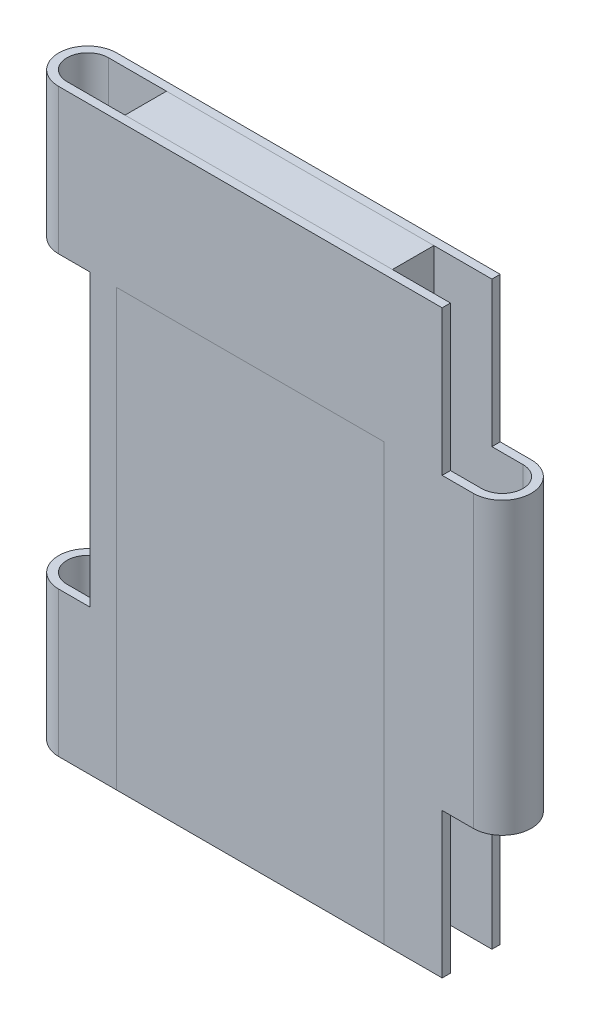
ISO-10303-21;
HEADER;
FILE_DESCRIPTION(('STEP AP214'),'2;1');
FILE_NAME('part.step','',(''),(''),'','','');
FILE_SCHEMA(('AUTOMOTIVE_DESIGN { 1 0 10303 214 1 1 1 1 }'));
ENDSEC;
DATA;
#1=APPLICATION_CONTEXT('core data for automotive mechanical design processes');
#2=APPLICATION_PROTOCOL_DEFINITION('international standard','automotive_design',2000,#1);
#3=PRODUCT_CONTEXT('',#1,'mechanical');
#4=PRODUCT('Part','Part','',(#3));
#5=PRODUCT_RELATED_PRODUCT_CATEGORY('part','',(#4));
#6=PRODUCT_DEFINITION_FORMATION('','',#4);
#7=PRODUCT_DEFINITION_CONTEXT('part definition',#1,'design');
#8=PRODUCT_DEFINITION('design','',#6,#7);
#9=PRODUCT_DEFINITION_SHAPE('','',#8);
#10=(LENGTH_UNIT() NAMED_UNIT(*) SI_UNIT(.MILLI.,.METRE.));
#11=(NAMED_UNIT(*) PLANE_ANGLE_UNIT() SI_UNIT($,.RADIAN.));
#12=(NAMED_UNIT(*) SI_UNIT($,.STERADIAN.) SOLID_ANGLE_UNIT());
#13=UNCERTAINTY_MEASURE_WITH_UNIT(LENGTH_MEASURE(1.E-05),#10,'distance_accuracy_value','');
#14=(GEOMETRIC_REPRESENTATION_CONTEXT(3) GLOBAL_UNCERTAINTY_ASSIGNED_CONTEXT((#13)) GLOBAL_UNIT_ASSIGNED_CONTEXT((#10,
#11,#12)) REPRESENTATION_CONTEXT('',''));
#15=CARTESIAN_POINT('',(0.,0.,0.));
#16=DIRECTION('',(0.,0.,1.));
#17=DIRECTION('',(1.,0.,0.));
#18=AXIS2_PLACEMENT_3D('',#15,#16,#17);
#19=CARTESIAN_POINT('',(-18.,0.,-3.50000000000002));
#20=DIRECTION('',(-1.,0.,0.));
#21=DIRECTION('',(0.,0.,1.));
#22=AXIS2_PLACEMENT_3D('',#19,#20,#21);
#23=PLANE('',#22);
#24=DIRECTION('',(0.,0.,1.));
#25=VECTOR('',#24,1.);
#26=CARTESIAN_POINT('',(-18.,70.,-3.50000000000002));
#27=LINE('',#26,#25);
#28=CARTESIAN_POINT('',(-18.,70.,-3.50000000000002));
#29=VERTEX_POINT('',#28);
#30=CARTESIAN_POINT('',(-18.,70.,3.50000000000001));
#31=VERTEX_POINT('',#30);
#32=EDGE_CURVE('E123',#29,#31,#27,.T.);
#33=ORIENTED_EDGE('',*,*,#32,.F.);
#34=DIRECTION('',(0.,1.,0.));
#35=VECTOR('',#34,1.);
#36=CARTESIAN_POINT('',(-18.,0.,-3.50000000000002));
#37=LINE('',#36,#35);
#38=CARTESIAN_POINT('',(-18.,0.,-3.50000000000002));
#39=VERTEX_POINT('',#38);
#40=EDGE_CURVE('E12',#39,#29,#37,.T.);
#41=ORIENTED_EDGE('',*,*,#40,.F.);
#42=DIRECTION('',(0.,0.,1.));
#43=VECTOR('',#42,1.);
#44=CARTESIAN_POINT('',(-18.,0.,-3.50000000000002));
#45=LINE('',#44,#43);
#46=CARTESIAN_POINT('',(-18.,0.,3.50000000000001));
#47=VERTEX_POINT('',#46);
#48=EDGE_CURVE('E115',#39,#47,#45,.T.);
#49=ORIENTED_EDGE('',*,*,#48,.T.);
#50=DIRECTION('',(0.,1.,0.));
#51=VECTOR('',#50,1.);
#52=CARTESIAN_POINT('',(-18.,0.,3.50000000000001));
#53=LINE('',#52,#51);
#54=EDGE_CURVE('E56',#47,#31,#53,.T.);
#55=ORIENTED_EDGE('',*,*,#54,.T.);
#56=EDGE_LOOP('',(#33,#41,#49,#55));
#57=FACE_BOUND('',#56,.T.);
#58=ADVANCED_FACE('F53',(#57),#23,.T.);
#59=CARTESIAN_POINT('',(-18.,0.,-3.50000000000002));
#60=DIRECTION('',(0.,0.,-1.));
#61=DIRECTION('',(-1.,0.,0.));
#62=AXIS2_PLACEMENT_3D('',#59,#60,#61);
#63=PLANE('',#62);
#64=DIRECTION('',(-1.,0.,0.));
#65=VECTOR('',#64,1.);
#66=CARTESIAN_POINT('',(-18.,70.,-3.50000000000002));
#67=LINE('',#66,#65);
#68=CARTESIAN_POINT('',(14.25,70.,-3.50000000000002));
#69=VERTEX_POINT('',#68);
#70=EDGE_CURVE('E118',#69,#29,#67,.T.);
#71=ORIENTED_EDGE('',*,*,#70,.F.);
#72=DIRECTION('',(0.,1.,0.));
#73=VECTOR('',#72,1.);
#74=CARTESIAN_POINT('',(14.25,0.,-3.50000000000002));
#75=LINE('',#74,#73);
#76=CARTESIAN_POINT('',(14.25,0.,-3.50000000000002));
#77=VERTEX_POINT('',#76);
#78=EDGE_CURVE('E63',#77,#69,#75,.T.);
#79=ORIENTED_EDGE('',*,*,#78,.F.);
#80=DIRECTION('',(-1.,0.,0.));
#81=VECTOR('',#80,1.);
#82=CARTESIAN_POINT('',(-18.,0.,-3.50000000000002));
#83=LINE('',#82,#81);
#84=EDGE_CURVE('E110',#77,#39,#83,.T.);
#85=ORIENTED_EDGE('',*,*,#84,.T.);
#86=ORIENTED_EDGE('',*,*,#40,.T.);
#87=EDGE_LOOP('',(#71,#79,#85,#86));
#88=FACE_BOUND('',#87,.T.);
#89=ADVANCED_FACE('F139',(#88),#63,.T.);
#90=CARTESIAN_POINT('',(14.25,0.,-3.50000000000002));
#91=DIRECTION('',(1.,0.,0.));
#92=DIRECTION('',(0.,0.,-1.));
#93=AXIS2_PLACEMENT_3D('',#90,#91,#92);
#94=PLANE('',#93);
#95=DIRECTION('',(0.,0.,-1.));
#96=VECTOR('',#95,1.);
#97=CARTESIAN_POINT('',(14.25,70.,-3.50000000000002));
#98=LINE('',#97,#96);
#99=CARTESIAN_POINT('',(14.25,70.,3.50000000000001));
#100=VERTEX_POINT('',#99);
#101=EDGE_CURVE('E104',#100,#69,#98,.T.);
#102=ORIENTED_EDGE('',*,*,#101,.F.);
#103=DIRECTION('',(0.,1.,0.));
#104=VECTOR('',#103,1.);
#105=CARTESIAN_POINT('',(14.25,0.,3.50000000000001));
#106=LINE('',#105,#104);
#107=CARTESIAN_POINT('',(14.25,0.,3.50000000000001));
#108=VERTEX_POINT('',#107);
#109=EDGE_CURVE('E99',#108,#100,#106,.T.);
#110=ORIENTED_EDGE('',*,*,#109,.F.);
#111=DIRECTION('',(0.,0.,-1.));
#112=VECTOR('',#111,1.);
#113=CARTESIAN_POINT('',(14.25,0.,-3.50000000000002));
#114=LINE('',#113,#112);
#115=EDGE_CURVE('E102',#108,#77,#114,.T.);
#116=ORIENTED_EDGE('',*,*,#115,.T.);
#117=ORIENTED_EDGE('',*,*,#78,.T.);
#118=EDGE_LOOP('',(#102,#110,#116,#117));
#119=FACE_BOUND('',#118,.T.);
#120=ADVANCED_FACE('F101',(#119),#94,.T.);
#121=CARTESIAN_POINT('',(-18.,0.,3.50000000000001));
#122=DIRECTION('',(0.,0.,1.));
#123=DIRECTION('',(1.,0.,0.));
#124=AXIS2_PLACEMENT_3D('',#121,#122,#123);
#125=PLANE('',#124);
#126=DIRECTION('',(1.,0.,0.));
#127=VECTOR('',#126,1.);
#128=CARTESIAN_POINT('',(-18.,70.,3.50000000000001));
#129=LINE('',#128,#127);
#130=EDGE_CURVE('E127',#31,#100,#129,.T.);
#131=ORIENTED_EDGE('',*,*,#130,.F.);
#132=ORIENTED_EDGE('',*,*,#54,.F.);
#133=DIRECTION('',(1.,0.,0.));
#134=VECTOR('',#133,1.);
#135=CARTESIAN_POINT('',(-18.,0.,3.50000000000001));
#136=LINE('',#135,#134);
#137=EDGE_CURVE('E109',#47,#108,#136,.T.);
#138=ORIENTED_EDGE('',*,*,#137,.T.);
#139=ORIENTED_EDGE('',*,*,#109,.T.);
#140=EDGE_LOOP('',(#131,#132,#138,#139));
#141=FACE_BOUND('',#140,.T.);
#142=ADVANCED_FACE('F113',(#141),#125,.T.);
#143=CARTESIAN_POINT('',(0.,0.,0.));
#144=DIRECTION('',(0.,1.,0.));
#145=DIRECTION('',(0.,0.,1.));
#146=AXIS2_PLACEMENT_3D('',#143,#144,#145);
#147=PLANE('',#146);
#148=ORIENTED_EDGE('',*,*,#48,.F.);
#149=ORIENTED_EDGE('',*,*,#84,.F.);
#150=ORIENTED_EDGE('',*,*,#115,.F.);
#151=ORIENTED_EDGE('',*,*,#137,.F.);
#152=EDGE_LOOP('',(#148,#149,#150,#151));
#153=FACE_BOUND('',#152,.T.);
#154=ADVANCED_FACE('F108',(#153),#147,.F.);
#155=CARTESIAN_POINT('',(0.,70.,0.));
#156=DIRECTION('',(0.,1.,0.));
#157=DIRECTION('',(0.,0.,1.));
#158=AXIS2_PLACEMENT_3D('',#155,#156,#157);
#159=PLANE('',#158);
#160=ORIENTED_EDGE('',*,*,#32,.T.);
#161=ORIENTED_EDGE('',*,*,#130,.T.);
#162=ORIENTED_EDGE('',*,*,#101,.T.);
#163=ORIENTED_EDGE('',*,*,#70,.T.);
#164=EDGE_LOOP('',(#160,#161,#162,#163));
#165=FACE_BOUND('',#164,.T.);
#166=ADVANCED_FACE('F138',(#165),#159,.T.);
#167=CLOSED_SHELL('',(#58,#89,#120,#142,#154,#166));
#168=MANIFOLD_SOLID_BREP('B2',#167);
#169=CARTESIAN_POINT('',(-25.,70.,0.));
#170=DIRECTION('',(0.,-1.,0.));
#171=DIRECTION('',(0.,0.,-1.));
#172=AXIS2_PLACEMENT_3D('',#169,#170,#171);
#173=CYLINDRICAL_SURFACE('',#172,3.50000000000001);
#174=DIRECTION('',(0.,-1.,0.));
#175=VECTOR('',#174,1.);
#176=CARTESIAN_POINT('',(-25.,70.,3.50000000000001));
#177=LINE('',#176,#175);
#178=CARTESIAN_POINT('',(-25.,17.5,3.5));
#179=VERTEX_POINT('',#178);
#180=CARTESIAN_POINT('',(-25.,0.,3.50000000000001));
#181=VERTEX_POINT('',#180);
#182=EDGE_CURVE('E501',#179,#181,#177,.T.);
#183=ORIENTED_EDGE('',*,*,#182,.F.);
#184=CARTESIAN_POINT('',(-25.,17.5,0.));
#185=DIRECTION('',(0.,-1.,0.));
#186=DIRECTION('',(0.,0.,-1.));
#187=AXIS2_PLACEMENT_3D('',#184,#185,#186);
#188=CIRCLE('',#187,3.50000000000001);
#189=CARTESIAN_POINT('',(-25.,17.5,-3.50000000000001));
#190=VERTEX_POINT('',#189);
#191=EDGE_CURVE('E431',#179,#190,#188,.T.);
#192=ORIENTED_EDGE('',*,*,#191,.T.);
#193=DIRECTION('',(0.,-1.,0.));
#194=VECTOR('',#193,1.);
#195=CARTESIAN_POINT('',(-25.,70.,-3.50000000000001));
#196=LINE('',#195,#194);
#197=CARTESIAN_POINT('',(-25.,0.,-3.50000000000001));
#198=VERTEX_POINT('',#197);
#199=EDGE_CURVE('E485',#190,#198,#196,.T.);
#200=ORIENTED_EDGE('',*,*,#199,.T.);
#201=CARTESIAN_POINT('',(-25.,0.,0.));
#202=DIRECTION('',(0.,1.,0.));
#203=DIRECTION('',(0.,0.,1.));
#204=AXIS2_PLACEMENT_3D('',#201,#202,#203);
#205=CIRCLE('',#204,3.50000000000001);
#206=EDGE_CURVE('E475',#198,#181,#205,.T.);
#207=ORIENTED_EDGE('',*,*,#206,.T.);
#208=EDGE_LOOP('',(#183,#192,#200,#207));
#209=FACE_BOUND('',#208,.T.);
#210=ADVANCED_FACE('F189',(#209),#173,.T.);
#211=CARTESIAN_POINT('',(-25.,70.,0.));
#212=DIRECTION('',(0.,-1.,0.));
#213=DIRECTION('',(0.,0.,-1.));
#214=AXIS2_PLACEMENT_3D('',#211,#212,#213);
#215=CYLINDRICAL_SURFACE('',#214,2.50000000000001);
#216=CARTESIAN_POINT('',(-25.,17.5,0.));
#217=DIRECTION('',(0.,-1.,0.));
#218=DIRECTION('',(0.,0.,-1.));
#219=AXIS2_PLACEMENT_3D('',#216,#217,#218);
#220=CIRCLE('',#219,2.50000000000001);
#221=CARTESIAN_POINT('',(-25.,17.5,2.50000000000001));
#222=VERTEX_POINT('',#221);
#223=CARTESIAN_POINT('',(-25.,17.5,-2.50000000000001));
#224=VERTEX_POINT('',#223);
#225=EDGE_CURVE('E427',#222,#224,#220,.T.);
#226=ORIENTED_EDGE('',*,*,#225,.F.);
#227=DIRECTION('',(0.,-1.,0.));
#228=VECTOR('',#227,1.);
#229=CARTESIAN_POINT('',(-25.,70.,2.50000000000001));
#230=LINE('',#229,#228);
#231=CARTESIAN_POINT('',(-25.,0.,2.50000000000001));
#232=VERTEX_POINT('',#231);
#233=EDGE_CURVE('E471',#222,#232,#230,.T.);
#234=ORIENTED_EDGE('',*,*,#233,.T.);
#235=CARTESIAN_POINT('',(-25.,0.,0.));
#236=DIRECTION('',(0.,1.,0.));
#237=DIRECTION('',(0.,0.,1.));
#238=AXIS2_PLACEMENT_3D('',#235,#236,#237);
#239=CIRCLE('',#238,2.50000000000001);
#240=CARTESIAN_POINT('',(-25.,0.,-2.50000000000001));
#241=VERTEX_POINT('',#240);
#242=EDGE_CURVE('E445',#241,#232,#239,.T.);
#243=ORIENTED_EDGE('',*,*,#242,.F.);
#244=DIRECTION('',(0.,-1.,0.));
#245=VECTOR('',#244,1.);
#246=CARTESIAN_POINT('',(-25.,70.,-2.50000000000001));
#247=LINE('',#246,#245);
#248=EDGE_CURVE('E454',#224,#241,#247,.T.);
#249=ORIENTED_EDGE('',*,*,#248,.F.);
#250=EDGE_LOOP('',(#226,#234,#243,#249));
#251=FACE_BOUND('',#250,.T.);
#252=ADVANCED_FACE('F534',(#251),#215,.F.);
#253=CARTESIAN_POINT('',(-25.,70.,0.));
#254=DIRECTION('',(0.,1.,0.));
#255=DIRECTION('',(0.,0.,1.));
#256=AXIS2_PLACEMENT_3D('',#253,#254,#255);
#257=PLANE('',#256);
#258=DIRECTION('',(0.,0.,1.));
#259=VECTOR('',#258,1.);
#260=CARTESIAN_POINT('',(21.25,70.,-39.2945526581909));
#261=LINE('',#260,#259);
#262=CARTESIAN_POINT('',(21.25,70.,-3.50000000000002));
#263=VERTEX_POINT('',#262);
#264=CARTESIAN_POINT('',(21.25,70.,-2.50000000000001));
#265=VERTEX_POINT('',#264);
#266=EDGE_CURVE('E413',#263,#265,#261,.T.);
#267=ORIENTED_EDGE('',*,*,#266,.F.);
#268=DIRECTION('',(-1.,0.,0.));
#269=VECTOR('',#268,1.);
#270=CARTESIAN_POINT('',(-25.,70.,-3.50000000000001));
#271=LINE('',#270,#269);
#272=CARTESIAN_POINT('',(-25.,70.,-3.50000000000001));
#273=VERTEX_POINT('',#272);
#274=EDGE_CURVE('E483',#263,#273,#271,.T.);
#275=ORIENTED_EDGE('',*,*,#274,.T.);
#276=CARTESIAN_POINT('',(-25.,70.,0.));
#277=DIRECTION('',(0.,1.,0.));
#278=DIRECTION('',(0.,0.,1.));
#279=AXIS2_PLACEMENT_3D('',#276,#277,#278);
#280=CIRCLE('',#279,3.50000000000001);
#281=CARTESIAN_POINT('',(-25.,70.,3.50000000000001));
#282=VERTEX_POINT('',#281);
#283=EDGE_CURVE('E476',#273,#282,#280,.T.);
#284=ORIENTED_EDGE('',*,*,#283,.T.);
#285=DIRECTION('',(1.,0.,0.));
#286=VECTOR('',#285,1.);
#287=CARTESIAN_POINT('',(-25.,70.,3.50000000000001));
#288=LINE('',#287,#286);
#289=CARTESIAN_POINT('',(21.25,70.,3.5));
#290=VERTEX_POINT('',#289);
#291=EDGE_CURVE('E479',#282,#290,#288,.T.);
#292=ORIENTED_EDGE('',*,*,#291,.T.);
#293=CARTESIAN_POINT('',(21.25,70.,2.5));
#294=VERTEX_POINT('',#293);
#295=EDGE_CURVE('E409',#294,#290,#261,.T.);
#296=ORIENTED_EDGE('',*,*,#295,.F.);
#297=DIRECTION('',(1.,0.,0.));
#298=VECTOR('',#297,1.);
#299=CARTESIAN_POINT('',(-25.,70.,2.50000000000001));
#300=LINE('',#299,#298);
#301=CARTESIAN_POINT('',(-25.,70.,2.50000000000001));
#302=VERTEX_POINT('',#301);
#303=EDGE_CURVE('E448',#302,#294,#300,.T.);
#304=ORIENTED_EDGE('',*,*,#303,.F.);
#305=CARTESIAN_POINT('',(-25.,70.,0.));
#306=DIRECTION('',(0.,1.,0.));
#307=DIRECTION('',(0.,0.,1.));
#308=AXIS2_PLACEMENT_3D('',#305,#306,#307);
#309=CIRCLE('',#308,2.50000000000001);
#310=CARTESIAN_POINT('',(-25.,70.,-2.50000000000001));
#311=VERTEX_POINT('',#310);
#312=EDGE_CURVE('E446',#311,#302,#309,.T.);
#313=ORIENTED_EDGE('',*,*,#312,.F.);
#314=DIRECTION('',(-1.,0.,0.));
#315=VECTOR('',#314,1.);
#316=CARTESIAN_POINT('',(-25.,70.,-2.50000000000001));
#317=LINE('',#316,#315);
#318=EDGE_CURVE('E452',#265,#311,#317,.T.);
#319=ORIENTED_EDGE('',*,*,#318,.F.);
#320=EDGE_LOOP('',(#267,#275,#284,#292,#296,#304,#313,#319));
#321=FACE_BOUND('',#320,.T.);
#322=ADVANCED_FACE('F579',(#321),#257,.T.);
#323=CARTESIAN_POINT('',(-25.,0.,0.));
#324=DIRECTION('',(0.,1.,0.));
#325=DIRECTION('',(0.,0.,1.));
#326=AXIS2_PLACEMENT_3D('',#323,#324,#325);
#327=PLANE('',#326);
#328=DIRECTION('',(-1.,0.,0.));
#329=VECTOR('',#328,1.);
#330=CARTESIAN_POINT('',(-25.,0.,-3.50000000000001));
#331=LINE('',#330,#329);
#332=CARTESIAN_POINT('',(21.25,0.,-3.50000000000002));
#333=VERTEX_POINT('',#332);
#334=EDGE_CURVE('E480',#333,#198,#331,.T.);
#335=ORIENTED_EDGE('',*,*,#334,.F.);
#336=DIRECTION('',(0.,0.,1.));
#337=VECTOR('',#336,1.);
#338=CARTESIAN_POINT('',(21.25,0.,-39.2945526581909));
#339=LINE('',#338,#337);
#340=CARTESIAN_POINT('',(21.25,0.,-2.50000000000001));
#341=VERTEX_POINT('',#340);
#342=EDGE_CURVE('E386',#333,#341,#339,.T.);
#343=ORIENTED_EDGE('',*,*,#342,.T.);
#344=DIRECTION('',(-1.,0.,0.));
#345=VECTOR('',#344,1.);
#346=CARTESIAN_POINT('',(-25.,0.,-2.50000000000001));
#347=LINE('',#346,#345);
#348=EDGE_CURVE('E449',#341,#241,#347,.T.);
#349=ORIENTED_EDGE('',*,*,#348,.T.);
#350=ORIENTED_EDGE('',*,*,#242,.T.);
#351=DIRECTION('',(1.,0.,0.));
#352=VECTOR('',#351,1.);
#353=CARTESIAN_POINT('',(-25.,0.,2.50000000000001));
#354=LINE('',#353,#352);
#355=CARTESIAN_POINT('',(21.25,0.,2.5));
#356=VERTEX_POINT('',#355);
#357=EDGE_CURVE('E457',#232,#356,#354,.T.);
#358=ORIENTED_EDGE('',*,*,#357,.T.);
#359=CARTESIAN_POINT('',(21.25,0.,3.5));
#360=VERTEX_POINT('',#359);
#361=EDGE_CURVE('E394',#356,#360,#339,.T.);
#362=ORIENTED_EDGE('',*,*,#361,.T.);
#363=DIRECTION('',(1.,0.,0.));
#364=VECTOR('',#363,1.);
#365=CARTESIAN_POINT('',(-25.,0.,3.50000000000001));
#366=LINE('',#365,#364);
#367=EDGE_CURVE('E488',#181,#360,#366,.T.);
#368=ORIENTED_EDGE('',*,*,#367,.F.);
#369=ORIENTED_EDGE('',*,*,#206,.F.);
#370=EDGE_LOOP('',(#335,#343,#349,#350,#358,#362,#368,#369));
#371=FACE_BOUND('',#370,.T.);
#372=ADVANCED_FACE('F531',(#371),#327,.F.);
#373=CARTESIAN_POINT('',(-25.,52.5,-3.50000000000001));
#374=VERTEX_POINT('',#373);
#375=EDGE_CURVE('E492',#273,#374,#196,.T.);
#376=ORIENTED_EDGE('',*,*,#375,.T.);
#377=CARTESIAN_POINT('',(-25.,52.5,0.));
#378=DIRECTION('',(0.,1.,0.));
#379=DIRECTION('',(0.,0.,1.));
#380=AXIS2_PLACEMENT_3D('',#377,#378,#379);
#381=CIRCLE('',#380,3.50000000000001);
#382=CARTESIAN_POINT('',(-25.,52.5,3.5));
#383=VERTEX_POINT('',#382);
#384=EDGE_CURVE('E204',#374,#383,#381,.T.);
#385=ORIENTED_EDGE('',*,*,#384,.T.);
#386=EDGE_CURVE('E371',#282,#383,#177,.T.);
#387=ORIENTED_EDGE('',*,*,#386,.F.);
#388=ORIENTED_EDGE('',*,*,#283,.F.);
#389=EDGE_LOOP('',(#376,#385,#387,#388));
#390=FACE_BOUND('',#389,.T.);
#391=ADVANCED_FACE('F191',(#390),#173,.T.);
#392=CARTESIAN_POINT('',(-25.,70.,3.50000000000001));
#393=DIRECTION('',(0.,0.,-1.));
#394=DIRECTION('',(-1.,0.,0.));
#395=AXIS2_PLACEMENT_3D('',#392,#393,#394);
#396=PLANE('',#395);
#397=ORIENTED_EDGE('',*,*,#367,.T.);
#398=DIRECTION('',(0.,-1.,0.));
#399=VECTOR('',#398,1.);
#400=CARTESIAN_POINT('',(21.25,17.5,3.5));
#401=LINE('',#400,#399);
#402=CARTESIAN_POINT('',(21.25,17.5,3.5));
#403=VERTEX_POINT('',#402);
#404=EDGE_CURVE('E389',#403,#360,#401,.T.);
#405=ORIENTED_EDGE('',*,*,#404,.F.);
#406=DIRECTION('',(-1.,0.,0.));
#407=VECTOR('',#406,1.);
#408=CARTESIAN_POINT('',(21.25,17.5,3.5));
#409=LINE('',#408,#407);
#410=CARTESIAN_POINT('',(25.,17.5,3.5));
#411=VERTEX_POINT('',#410);
#412=EDGE_CURVE('E387',#411,#403,#409,.T.);
#413=ORIENTED_EDGE('',*,*,#412,.F.);
#414=DIRECTION('',(0.,-1.,0.));
#415=VECTOR('',#414,1.);
#416=CARTESIAN_POINT('',(25.,70.,3.5));
#417=LINE('',#416,#415);
#418=CARTESIAN_POINT('',(25.,52.5,3.5));
#419=VERTEX_POINT('',#418);
#420=EDGE_CURVE('E498',#419,#411,#417,.T.);
#421=ORIENTED_EDGE('',*,*,#420,.F.);
#422=DIRECTION('',(1.,0.,0.));
#423=VECTOR('',#422,1.);
#424=CARTESIAN_POINT('',(21.25,52.5,3.5));
#425=LINE('',#424,#423);
#426=CARTESIAN_POINT('',(21.25,52.5,3.5));
#427=VERTEX_POINT('',#426);
#428=EDGE_CURVE('E407',#427,#419,#425,.T.);
#429=ORIENTED_EDGE('',*,*,#428,.F.);
#430=DIRECTION('',(0.,-1.,0.));
#431=VECTOR('',#430,1.);
#432=CARTESIAN_POINT('',(21.25,52.5,3.5));
#433=LINE('',#432,#431);
#434=EDGE_CURVE('E382',#290,#427,#433,.T.);
#435=ORIENTED_EDGE('',*,*,#434,.F.);
#436=ORIENTED_EDGE('',*,*,#291,.F.);
#437=ORIENTED_EDGE('',*,*,#386,.T.);
#438=DIRECTION('',(-1.,0.,0.));
#439=VECTOR('',#438,1.);
#440=CARTESIAN_POINT('',(-28.75,52.5,3.5));
#441=LINE('',#440,#439);
#442=CARTESIAN_POINT('',(-21.25,52.5,3.5));
#443=VERTEX_POINT('',#442);
#444=EDGE_CURVE('E350',#443,#383,#441,.T.);
#445=ORIENTED_EDGE('',*,*,#444,.F.);
#446=DIRECTION('',(0.,1.,0.));
#447=VECTOR('',#446,1.);
#448=CARTESIAN_POINT('',(-21.25,17.5,3.5));
#449=LINE('',#448,#447);
#450=CARTESIAN_POINT('',(-21.25,17.5,3.5));
#451=VERTEX_POINT('',#450);
#452=EDGE_CURVE('E359',#451,#443,#449,.T.);
#453=ORIENTED_EDGE('',*,*,#452,.F.);
#454=DIRECTION('',(1.,0.,0.));
#455=VECTOR('',#454,1.);
#456=CARTESIAN_POINT('',(-28.75,17.5,3.5));
#457=LINE('',#456,#455);
#458=EDGE_CURVE('E355',#179,#451,#457,.T.);
#459=ORIENTED_EDGE('',*,*,#458,.F.);
#460=ORIENTED_EDGE('',*,*,#182,.T.);
#461=EDGE_LOOP('',(#397,#405,#413,#421,#429,#435,#436,#437,#445,#453,#459,#460));
#462=FACE_BOUND('',#461,.T.);
#463=ADVANCED_FACE('F369',(#462),#396,.F.);
#464=CARTESIAN_POINT('',(25.,70.,0.));
#465=DIRECTION('',(0.,-1.,0.));
#466=DIRECTION('',(0.,0.,-1.));
#467=AXIS2_PLACEMENT_3D('',#464,#465,#466);
#468=CYLINDRICAL_SURFACE('',#467,3.50000000000001);
#469=ORIENTED_EDGE('',*,*,#420,.T.);
#470=CARTESIAN_POINT('',(25.,17.5,0.));
#471=DIRECTION('',(0.,1.,0.));
#472=DIRECTION('',(0.,0.,1.));
#473=AXIS2_PLACEMENT_3D('',#470,#471,#472);
#474=CIRCLE('',#473,3.50000000000001);
#475=CARTESIAN_POINT('',(25.,17.5,-3.50000000000002));
#476=VERTEX_POINT('',#475);
#477=EDGE_CURVE('E440',#411,#476,#474,.T.);
#478=ORIENTED_EDGE('',*,*,#477,.T.);
#479=DIRECTION('',(0.,-1.,0.));
#480=VECTOR('',#479,1.);
#481=CARTESIAN_POINT('',(25.,70.,-3.50000000000002));
#482=LINE('',#481,#480);
#483=CARTESIAN_POINT('',(25.,52.5,-3.50000000000002));
#484=VERTEX_POINT('',#483);
#485=EDGE_CURVE('E495',#484,#476,#482,.T.);
#486=ORIENTED_EDGE('',*,*,#485,.F.);
#487=CARTESIAN_POINT('',(25.,52.5,0.));
#488=DIRECTION('',(0.,-1.,0.));
#489=DIRECTION('',(0.,0.,-1.));
#490=AXIS2_PLACEMENT_3D('',#487,#488,#489);
#491=CIRCLE('',#490,3.50000000000001);
#492=EDGE_CURVE('E420',#484,#419,#491,.T.);
#493=ORIENTED_EDGE('',*,*,#492,.T.);
#494=EDGE_LOOP('',(#469,#478,#486,#493));
#495=FACE_BOUND('',#494,.T.);
#496=ADVANCED_FACE('F557',(#495),#468,.T.);
#497=CARTESIAN_POINT('',(-25.,70.,-3.50000000000001));
#498=DIRECTION('',(0.,0.,1.));
#499=DIRECTION('',(1.,0.,0.));
#500=AXIS2_PLACEMENT_3D('',#497,#498,#499);
#501=PLANE('',#500);
#502=DIRECTION('',(1.,0.,0.));
#503=VECTOR('',#502,1.);
#504=CARTESIAN_POINT('',(21.25,17.5,-3.50000000000002));
#505=LINE('',#504,#503);
#506=CARTESIAN_POINT('',(21.25,17.5,-3.50000000000002));
#507=VERTEX_POINT('',#506);
#508=EDGE_CURVE('E365',#507,#476,#505,.T.);
#509=ORIENTED_EDGE('',*,*,#508,.F.);
#510=DIRECTION('',(0.,1.,0.));
#511=VECTOR('',#510,1.);
#512=CARTESIAN_POINT('',(21.25,17.5,-3.50000000000002));
#513=LINE('',#512,#511);
#514=EDGE_CURVE('E384',#333,#507,#513,.T.);
#515=ORIENTED_EDGE('',*,*,#514,.F.);
#516=ORIENTED_EDGE('',*,*,#334,.T.);
#517=ORIENTED_EDGE('',*,*,#199,.F.);
#518=DIRECTION('',(-1.,0.,0.));
#519=VECTOR('',#518,1.);
#520=CARTESIAN_POINT('',(-28.75,17.5,-3.50000000000001));
#521=LINE('',#520,#519);
#522=CARTESIAN_POINT('',(-21.25,17.5,-3.50000000000001));
#523=VERTEX_POINT('',#522);
#524=EDGE_CURVE('E378',#523,#190,#521,.T.);
#525=ORIENTED_EDGE('',*,*,#524,.F.);
#526=DIRECTION('',(0.,-1.,0.));
#527=VECTOR('',#526,1.);
#528=CARTESIAN_POINT('',(-21.25,17.5,-3.50000000000001));
#529=LINE('',#528,#527);
#530=CARTESIAN_POINT('',(-21.25,52.5,-3.50000000000001));
#531=VERTEX_POINT('',#530);
#532=EDGE_CURVE('E383',#531,#523,#529,.T.);
#533=ORIENTED_EDGE('',*,*,#532,.F.);
#534=DIRECTION('',(1.,0.,0.));
#535=VECTOR('',#534,1.);
#536=CARTESIAN_POINT('',(-28.75,52.5,-3.50000000000001));
#537=LINE('',#536,#535);
#538=EDGE_CURVE('E380',#374,#531,#537,.T.);
#539=ORIENTED_EDGE('',*,*,#538,.F.);
#540=ORIENTED_EDGE('',*,*,#375,.F.);
#541=ORIENTED_EDGE('',*,*,#274,.F.);
#542=DIRECTION('',(0.,1.,0.));
#543=VECTOR('',#542,1.);
#544=CARTESIAN_POINT('',(21.25,52.5,-3.50000000000002));
#545=LINE('',#544,#543);
#546=CARTESIAN_POINT('',(21.25,52.5,-3.50000000000002));
#547=VERTEX_POINT('',#546);
#548=EDGE_CURVE('E399',#547,#263,#545,.T.);
#549=ORIENTED_EDGE('',*,*,#548,.F.);
#550=DIRECTION('',(-1.,0.,0.));
#551=VECTOR('',#550,1.);
#552=CARTESIAN_POINT('',(21.25,52.5,-3.50000000000002));
#553=LINE('',#552,#551);
#554=EDGE_CURVE('E401',#484,#547,#553,.T.);
#555=ORIENTED_EDGE('',*,*,#554,.F.);
#556=ORIENTED_EDGE('',*,*,#485,.T.);
#557=EDGE_LOOP('',(#509,#515,#516,#517,#525,#533,#539,#540,#541,#549,#555,#556));
#558=FACE_BOUND('',#557,.T.);
#559=ADVANCED_FACE('F552',(#558),#501,.F.);
#560=CARTESIAN_POINT('',(-25.,52.5,0.));
#561=DIRECTION('',(0.,1.,0.));
#562=DIRECTION('',(0.,0.,1.));
#563=AXIS2_PLACEMENT_3D('',#560,#561,#562);
#564=CIRCLE('',#563,2.50000000000001);
#565=CARTESIAN_POINT('',(-25.,52.5,-2.50000000000001));
#566=VERTEX_POINT('',#565);
#567=CARTESIAN_POINT('',(-25.,52.5,2.50000000000001));
#568=VERTEX_POINT('',#567);
#569=EDGE_CURVE('E423',#566,#568,#564,.T.);
#570=ORIENTED_EDGE('',*,*,#569,.F.);
#571=EDGE_CURVE('E462',#311,#566,#247,.T.);
#572=ORIENTED_EDGE('',*,*,#571,.F.);
#573=ORIENTED_EDGE('',*,*,#312,.T.);
#574=EDGE_CURVE('E472',#302,#568,#230,.T.);
#575=ORIENTED_EDGE('',*,*,#574,.T.);
#576=EDGE_LOOP('',(#570,#572,#573,#575));
#577=FACE_BOUND('',#576,.T.);
#578=ADVANCED_FACE('F581',(#577),#215,.F.);
#579=CARTESIAN_POINT('',(-25.,70.,2.50000000000001));
#580=DIRECTION('',(0.,0.,-1.));
#581=DIRECTION('',(-1.,0.,0.));
#582=AXIS2_PLACEMENT_3D('',#579,#580,#581);
#583=PLANE('',#582);
#584=DIRECTION('',(0.,1.,0.));
#585=VECTOR('',#584,1.);
#586=CARTESIAN_POINT('',(21.25,70.,2.49999999999999));
#587=LINE('',#586,#585);
#588=CARTESIAN_POINT('',(21.25,17.5,2.5));
#589=VERTEX_POINT('',#588);
#590=EDGE_CURVE('E443',#356,#589,#587,.T.);
#591=ORIENTED_EDGE('',*,*,#590,.F.);
#592=ORIENTED_EDGE('',*,*,#357,.F.);
#593=ORIENTED_EDGE('',*,*,#233,.F.);
#594=DIRECTION('',(-1.,0.,0.));
#595=VECTOR('',#594,1.);
#596=CARTESIAN_POINT('',(-25.,17.5,2.50000000000001));
#597=LINE('',#596,#595);
#598=CARTESIAN_POINT('',(-21.25,17.5,2.50000000000001));
#599=VERTEX_POINT('',#598);
#600=EDGE_CURVE('E429',#599,#222,#597,.T.);
#601=ORIENTED_EDGE('',*,*,#600,.F.);
#602=DIRECTION('',(0.,-1.,0.));
#603=VECTOR('',#602,1.);
#604=CARTESIAN_POINT('',(-21.25,70.,2.50000000000001));
#605=LINE('',#604,#603);
#606=CARTESIAN_POINT('',(-21.25,52.5,2.50000000000001));
#607=VERTEX_POINT('',#606);
#608=EDGE_CURVE('E434',#607,#599,#605,.T.);
#609=ORIENTED_EDGE('',*,*,#608,.F.);
#610=DIRECTION('',(1.,0.,0.));
#611=VECTOR('',#610,1.);
#612=CARTESIAN_POINT('',(-25.,52.5,2.50000000000001));
#613=LINE('',#612,#611);
#614=EDGE_CURVE('E352',#568,#607,#613,.T.);
#615=ORIENTED_EDGE('',*,*,#614,.F.);
#616=ORIENTED_EDGE('',*,*,#574,.F.);
#617=ORIENTED_EDGE('',*,*,#303,.T.);
#618=DIRECTION('',(0.,1.,0.));
#619=VECTOR('',#618,1.);
#620=CARTESIAN_POINT('',(21.25,70.,2.49999999999999));
#621=LINE('',#620,#619);
#622=CARTESIAN_POINT('',(21.25,52.5,2.5));
#623=VERTEX_POINT('',#622);
#624=EDGE_CURVE('E404',#623,#294,#621,.T.);
#625=ORIENTED_EDGE('',*,*,#624,.F.);
#626=DIRECTION('',(-1.,0.,0.));
#627=VECTOR('',#626,1.);
#628=CARTESIAN_POINT('',(-25.,52.5,2.50000000000001));
#629=LINE('',#628,#627);
#630=CARTESIAN_POINT('',(25.,52.5,2.49999999999999));
#631=VERTEX_POINT('',#630);
#632=EDGE_CURVE('E418',#631,#623,#629,.T.);
#633=ORIENTED_EDGE('',*,*,#632,.F.);
#634=DIRECTION('',(0.,-1.,0.));
#635=VECTOR('',#634,1.);
#636=CARTESIAN_POINT('',(25.,70.,2.49999999999999));
#637=LINE('',#636,#635);
#638=CARTESIAN_POINT('',(25.,17.5,2.49999999999999));
#639=VERTEX_POINT('',#638);
#640=EDGE_CURVE('E468',#631,#639,#637,.T.);
#641=ORIENTED_EDGE('',*,*,#640,.T.);
#642=DIRECTION('',(1.,0.,0.));
#643=VECTOR('',#642,1.);
#644=CARTESIAN_POINT('',(-25.,17.5,2.50000000000001));
#645=LINE('',#644,#643);
#646=EDGE_CURVE('E438',#589,#639,#645,.T.);
#647=ORIENTED_EDGE('',*,*,#646,.F.);
#648=EDGE_LOOP('',(#591,#592,#593,#601,#609,#615,#616,#617,#625,#633,#641,#647));
#649=FACE_BOUND('',#648,.T.);
#650=ADVANCED_FACE('F540',(#649),#583,.T.);
#651=CARTESIAN_POINT('',(25.,70.,0.));
#652=DIRECTION('',(0.,-1.,0.));
#653=DIRECTION('',(0.,0.,-1.));
#654=AXIS2_PLACEMENT_3D('',#651,#652,#653);
#655=CYLINDRICAL_SURFACE('',#654,2.5);
#656=CARTESIAN_POINT('',(25.,17.5,0.));
#657=DIRECTION('',(0.,1.,0.));
#658=DIRECTION('',(0.,0.,1.));
#659=AXIS2_PLACEMENT_3D('',#656,#657,#658);
#660=CIRCLE('',#659,2.5);
#661=CARTESIAN_POINT('',(25.,17.5,-2.50000000000001));
#662=VERTEX_POINT('',#661);
#663=EDGE_CURVE('E436',#639,#662,#660,.T.);
#664=ORIENTED_EDGE('',*,*,#663,.F.);
#665=ORIENTED_EDGE('',*,*,#640,.F.);
#666=CARTESIAN_POINT('',(25.,52.5,0.));
#667=DIRECTION('',(0.,-1.,0.));
#668=DIRECTION('',(0.,0.,-1.));
#669=AXIS2_PLACEMENT_3D('',#666,#667,#668);
#670=CIRCLE('',#669,2.5);
#671=CARTESIAN_POINT('',(25.,52.5,-2.50000000000001));
#672=VERTEX_POINT('',#671);
#673=EDGE_CURVE('E416',#672,#631,#670,.T.);
#674=ORIENTED_EDGE('',*,*,#673,.F.);
#675=DIRECTION('',(0.,-1.,0.));
#676=VECTOR('',#675,1.);
#677=CARTESIAN_POINT('',(25.,70.,-2.50000000000001));
#678=LINE('',#677,#676);
#679=EDGE_CURVE('E465',#672,#662,#678,.T.);
#680=ORIENTED_EDGE('',*,*,#679,.T.);
#681=EDGE_LOOP('',(#664,#665,#674,#680));
#682=FACE_BOUND('',#681,.T.);
#683=ADVANCED_FACE('F622',(#682),#655,.F.);
#684=CARTESIAN_POINT('',(-25.,70.,-2.50000000000001));
#685=DIRECTION('',(0.,0.,1.));
#686=DIRECTION('',(1.,0.,0.));
#687=AXIS2_PLACEMENT_3D('',#684,#685,#686);
#688=PLANE('',#687);
#689=DIRECTION('',(0.,-1.,0.));
#690=VECTOR('',#689,1.);
#691=CARTESIAN_POINT('',(21.25,70.,-2.50000000000001));
#692=LINE('',#691,#690);
#693=CARTESIAN_POINT('',(21.25,17.5,-2.50000000000001));
#694=VERTEX_POINT('',#693);
#695=EDGE_CURVE('E51',#694,#341,#692,.T.);
#696=ORIENTED_EDGE('',*,*,#695,.F.);
#697=DIRECTION('',(-1.,0.,0.));
#698=VECTOR('',#697,1.);
#699=CARTESIAN_POINT('',(-25.,17.5,-2.50000000000001));
#700=LINE('',#699,#698);
#701=EDGE_CURVE('E197',#662,#694,#700,.T.);
#702=ORIENTED_EDGE('',*,*,#701,.F.);
#703=ORIENTED_EDGE('',*,*,#679,.F.);
#704=DIRECTION('',(1.,0.,0.));
#705=VECTOR('',#704,1.);
#706=CARTESIAN_POINT('',(-25.,52.5,-2.50000000000001));
#707=LINE('',#706,#705);
#708=CARTESIAN_POINT('',(21.25,52.5,-2.50000000000001));
#709=VERTEX_POINT('',#708);
#710=EDGE_CURVE('E505',#709,#672,#707,.T.);
#711=ORIENTED_EDGE('',*,*,#710,.F.);
#712=DIRECTION('',(0.,-1.,0.));
#713=VECTOR('',#712,1.);
#714=CARTESIAN_POINT('',(21.25,70.,-2.50000000000001));
#715=LINE('',#714,#713);
#716=EDGE_CURVE('E503',#265,#709,#715,.T.);
#717=ORIENTED_EDGE('',*,*,#716,.F.);
#718=ORIENTED_EDGE('',*,*,#318,.T.);
#719=ORIENTED_EDGE('',*,*,#571,.T.);
#720=DIRECTION('',(-1.,0.,0.));
#721=VECTOR('',#720,1.);
#722=CARTESIAN_POINT('',(-25.,52.5,-2.50000000000001));
#723=LINE('',#722,#721);
#724=CARTESIAN_POINT('',(-21.25,52.5,-2.50000000000001));
#725=VERTEX_POINT('',#724);
#726=EDGE_CURVE('E507',#725,#566,#723,.T.);
#727=ORIENTED_EDGE('',*,*,#726,.F.);
#728=DIRECTION('',(0.,1.,0.));
#729=VECTOR('',#728,1.);
#730=CARTESIAN_POINT('',(-21.25,70.,-2.50000000000001));
#731=LINE('',#730,#729);
#732=CARTESIAN_POINT('',(-21.25,17.5,-2.50000000000001));
#733=VERTEX_POINT('',#732);
#734=EDGE_CURVE('E509',#733,#725,#731,.T.);
#735=ORIENTED_EDGE('',*,*,#734,.F.);
#736=DIRECTION('',(1.,0.,0.));
#737=VECTOR('',#736,1.);
#738=CARTESIAN_POINT('',(-25.,17.5,-2.50000000000001));
#739=LINE('',#738,#737);
#740=EDGE_CURVE('E511',#224,#733,#739,.T.);
#741=ORIENTED_EDGE('',*,*,#740,.F.);
#742=ORIENTED_EDGE('',*,*,#248,.T.);
#743=ORIENTED_EDGE('',*,*,#348,.F.);
#744=EDGE_LOOP('',(#696,#702,#703,#711,#717,#718,#719,#727,#735,#741,#742,#743));
#745=FACE_BOUND('',#744,.T.);
#746=ADVANCED_FACE('F525',(#745),#688,.T.);
#747=CARTESIAN_POINT('',(21.25,52.5,-39.2945526581909));
#748=DIRECTION('',(0.,-1.,0.));
#749=DIRECTION('',(0.,0.,-1.));
#750=AXIS2_PLACEMENT_3D('',#747,#748,#749);
#751=PLANE('',#750);
#752=ORIENTED_EDGE('',*,*,#554,.T.);
#753=DIRECTION('',(0.,0.,1.));
#754=VECTOR('',#753,1.);
#755=CARTESIAN_POINT('',(21.25,52.5,-39.2945526581909));
#756=LINE('',#755,#754);
#757=EDGE_CURVE('E402',#547,#709,#756,.T.);
#758=ORIENTED_EDGE('',*,*,#757,.T.);
#759=ORIENTED_EDGE('',*,*,#710,.T.);
#760=ORIENTED_EDGE('',*,*,#673,.T.);
#761=ORIENTED_EDGE('',*,*,#632,.T.);
#762=EDGE_CURVE('E412',#623,#427,#756,.T.);
#763=ORIENTED_EDGE('',*,*,#762,.T.);
#764=ORIENTED_EDGE('',*,*,#428,.T.);
#765=ORIENTED_EDGE('',*,*,#492,.F.);
#766=EDGE_LOOP('',(#752,#758,#759,#760,#761,#763,#764,#765));
#767=FACE_BOUND('',#766,.T.);
#768=ADVANCED_FACE('F618',(#767),#751,.F.);
#769=CARTESIAN_POINT('',(21.25,52.5,-39.2945526581909));
#770=DIRECTION('',(-1.,0.,0.));
#771=DIRECTION('',(0.,0.,1.));
#772=AXIS2_PLACEMENT_3D('',#769,#770,#771);
#773=PLANE('',#772);
#774=ORIENTED_EDGE('',*,*,#624,.T.);
#775=ORIENTED_EDGE('',*,*,#295,.T.);
#776=ORIENTED_EDGE('',*,*,#434,.T.);
#777=ORIENTED_EDGE('',*,*,#762,.F.);
#778=EDGE_LOOP('',(#774,#775,#776,#777));
#779=FACE_BOUND('',#778,.T.);
#780=ADVANCED_FACE('F609',(#779),#773,.F.);
#781=ORIENTED_EDGE('',*,*,#716,.T.);
#782=ORIENTED_EDGE('',*,*,#757,.F.);
#783=ORIENTED_EDGE('',*,*,#548,.T.);
#784=ORIENTED_EDGE('',*,*,#266,.T.);
#785=EDGE_LOOP('',(#781,#782,#783,#784));
#786=FACE_BOUND('',#785,.T.);
#787=ADVANCED_FACE('F613',(#786),#773,.F.);
#788=CARTESIAN_POINT('',(-21.25,17.5,-39.2945526581909));
#789=DIRECTION('',(1.,0.,0.));
#790=DIRECTION('',(0.,0.,-1.));
#791=AXIS2_PLACEMENT_3D('',#788,#789,#790);
#792=PLANE('',#791);
#793=ORIENTED_EDGE('',*,*,#608,.T.);
#794=DIRECTION('',(0.,0.,1.));
#795=VECTOR('',#794,1.);
#796=CARTESIAN_POINT('',(-21.25,17.5,-39.2945526581909));
#797=LINE('',#796,#795);
#798=EDGE_CURVE('E362',#599,#451,#797,.T.);
#799=ORIENTED_EDGE('',*,*,#798,.T.);
#800=ORIENTED_EDGE('',*,*,#452,.T.);
#801=DIRECTION('',(0.,0.,1.));
#802=VECTOR('',#801,1.);
#803=CARTESIAN_POINT('',(-21.25,52.5,-39.2945526581909));
#804=LINE('',#803,#802);
#805=EDGE_CURVE('E346',#607,#443,#804,.T.);
#806=ORIENTED_EDGE('',*,*,#805,.F.);
#807=EDGE_LOOP('',(#793,#799,#800,#806));
#808=FACE_BOUND('',#807,.T.);
#809=ADVANCED_FACE('F360',(#808),#792,.F.);
#810=CARTESIAN_POINT('',(-28.75,17.5,-39.2945526581909));
#811=DIRECTION('',(0.,-1.,0.));
#812=DIRECTION('',(0.,0.,-1.));
#813=AXIS2_PLACEMENT_3D('',#810,#811,#812);
#814=PLANE('',#813);
#815=ORIENTED_EDGE('',*,*,#458,.T.);
#816=ORIENTED_EDGE('',*,*,#798,.F.);
#817=ORIENTED_EDGE('',*,*,#600,.T.);
#818=ORIENTED_EDGE('',*,*,#225,.T.);
#819=ORIENTED_EDGE('',*,*,#740,.T.);
#820=EDGE_CURVE('E376',#523,#733,#797,.T.);
#821=ORIENTED_EDGE('',*,*,#820,.F.);
#822=ORIENTED_EDGE('',*,*,#524,.T.);
#823=ORIENTED_EDGE('',*,*,#191,.F.);
#824=EDGE_LOOP('',(#815,#816,#817,#818,#819,#821,#822,#823));
#825=FACE_BOUND('',#824,.T.);
#826=ADVANCED_FACE('F698',(#825),#814,.F.);
#827=CARTESIAN_POINT('',(-28.75,52.5,-39.2945526581909));
#828=DIRECTION('',(0.,1.,0.));
#829=DIRECTION('',(0.,0.,1.));
#830=AXIS2_PLACEMENT_3D('',#827,#828,#829);
#831=PLANE('',#830);
#832=ORIENTED_EDGE('',*,*,#538,.T.);
#833=EDGE_CURVE('E210',#531,#725,#804,.T.);
#834=ORIENTED_EDGE('',*,*,#833,.T.);
#835=ORIENTED_EDGE('',*,*,#726,.T.);
#836=ORIENTED_EDGE('',*,*,#569,.T.);
#837=ORIENTED_EDGE('',*,*,#614,.T.);
#838=ORIENTED_EDGE('',*,*,#805,.T.);
#839=ORIENTED_EDGE('',*,*,#444,.T.);
#840=ORIENTED_EDGE('',*,*,#384,.F.);
#841=EDGE_LOOP('',(#832,#834,#835,#836,#837,#838,#839,#840));
#842=FACE_BOUND('',#841,.T.);
#843=ADVANCED_FACE('F348',(#842),#831,.F.);
#844=ORIENTED_EDGE('',*,*,#734,.T.);
#845=ORIENTED_EDGE('',*,*,#833,.F.);
#846=ORIENTED_EDGE('',*,*,#532,.T.);
#847=ORIENTED_EDGE('',*,*,#820,.T.);
#848=EDGE_LOOP('',(#844,#845,#846,#847));
#849=FACE_BOUND('',#848,.T.);
#850=ADVANCED_FACE('F565',(#849),#792,.F.);
#851=CARTESIAN_POINT('',(21.25,17.5,-39.2945526581909));
#852=DIRECTION('',(-1.,0.,0.));
#853=DIRECTION('',(0.,0.,1.));
#854=AXIS2_PLACEMENT_3D('',#851,#852,#853);
#855=PLANE('',#854);
#856=ORIENTED_EDGE('',*,*,#590,.T.);
#857=DIRECTION('',(0.,0.,1.));
#858=VECTOR('',#857,1.);
#859=CARTESIAN_POINT('',(21.25,17.5,-39.2945526581909));
#860=LINE('',#859,#858);
#861=EDGE_CURVE('E391',#589,#403,#860,.T.);
#862=ORIENTED_EDGE('',*,*,#861,.T.);
#863=ORIENTED_EDGE('',*,*,#404,.T.);
#864=ORIENTED_EDGE('',*,*,#361,.F.);
#865=EDGE_LOOP('',(#856,#862,#863,#864));
#866=FACE_BOUND('',#865,.T.);
#867=ADVANCED_FACE('F563',(#866),#855,.F.);
#868=CARTESIAN_POINT('',(21.25,17.5,-39.2945526581909));
#869=DIRECTION('',(0.,1.,0.));
#870=DIRECTION('',(0.,0.,1.));
#871=AXIS2_PLACEMENT_3D('',#868,#869,#870);
#872=PLANE('',#871);
#873=ORIENTED_EDGE('',*,*,#412,.T.);
#874=ORIENTED_EDGE('',*,*,#861,.F.);
#875=ORIENTED_EDGE('',*,*,#646,.T.);
#876=ORIENTED_EDGE('',*,*,#663,.T.);
#877=ORIENTED_EDGE('',*,*,#701,.T.);
#878=EDGE_CURVE('E395',#507,#694,#860,.T.);
#879=ORIENTED_EDGE('',*,*,#878,.F.);
#880=ORIENTED_EDGE('',*,*,#508,.T.);
#881=ORIENTED_EDGE('',*,*,#477,.F.);
#882=EDGE_LOOP('',(#873,#874,#875,#876,#877,#879,#880,#881));
#883=FACE_BOUND('',#882,.T.);
#884=ADVANCED_FACE('F515',(#883),#872,.F.);
#885=ORIENTED_EDGE('',*,*,#695,.T.);
#886=ORIENTED_EDGE('',*,*,#342,.F.);
#887=ORIENTED_EDGE('',*,*,#514,.T.);
#888=ORIENTED_EDGE('',*,*,#878,.T.);
#889=EDGE_LOOP('',(#885,#886,#887,#888));
#890=FACE_BOUND('',#889,.T.);
#891=ADVANCED_FACE('F522',(#890),#855,.F.);
#892=CLOSED_SHELL('',(#210,#252,#322,#372,#391,#463,#496,#559,#578,#650,#683,#746,#768,#780,
#787,#809,#826,#843,#850,#867,#884,#891));
#893=MANIFOLD_SOLID_BREP('B6',#892);
#894=ADVANCED_BREP_SHAPE_REPRESENTATION('',(#18,#168,#893),#14);
#895=SHAPE_DEFINITION_REPRESENTATION(#9,#894);
ENDSEC;
END-ISO-10303-21;
